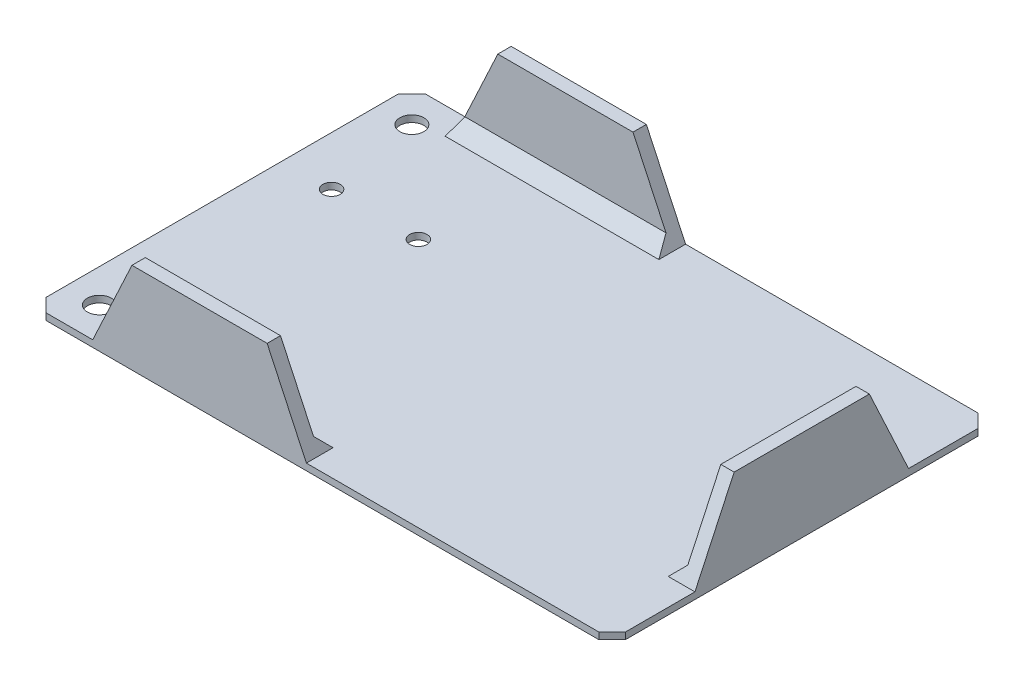
ISO-10303-21;
HEADER;
FILE_DESCRIPTION(('STEP AP214'),'2;1');
FILE_NAME('part.step','',(''),(''),'','','');
FILE_SCHEMA(('AUTOMOTIVE_DESIGN { 1 0 10303 214 1 1 1 1 }'));
ENDSEC;
DATA;
#1=APPLICATION_CONTEXT('core data for automotive mechanical design processes');
#2=APPLICATION_PROTOCOL_DEFINITION('international standard','automotive_design',2000,#1);
#3=PRODUCT_CONTEXT('',#1,'mechanical');
#4=PRODUCT('Part','Part','',(#3));
#5=PRODUCT_RELATED_PRODUCT_CATEGORY('part','',(#4));
#6=PRODUCT_DEFINITION_FORMATION('','',#4);
#7=PRODUCT_DEFINITION_CONTEXT('part definition',#1,'design');
#8=PRODUCT_DEFINITION('design','',#6,#7);
#9=PRODUCT_DEFINITION_SHAPE('','',#8);
#10=(LENGTH_UNIT() NAMED_UNIT(*) SI_UNIT(.MILLI.,.METRE.));
#11=(NAMED_UNIT(*) PLANE_ANGLE_UNIT() SI_UNIT($,.RADIAN.));
#12=(NAMED_UNIT(*) SI_UNIT($,.STERADIAN.) SOLID_ANGLE_UNIT());
#13=UNCERTAINTY_MEASURE_WITH_UNIT(LENGTH_MEASURE(1.E-05),#10,'distance_accuracy_value','');
#14=(GEOMETRIC_REPRESENTATION_CONTEXT(3) GLOBAL_UNCERTAINTY_ASSIGNED_CONTEXT((#13)) GLOBAL_UNIT_ASSIGNED_CONTEXT((#10,
#11,#12)) REPRESENTATION_CONTEXT('',''));
#15=CARTESIAN_POINT('',(0.,0.,0.));
#16=DIRECTION('',(0.,0.,1.));
#17=DIRECTION('',(1.,0.,0.));
#18=AXIS2_PLACEMENT_3D('',#15,#16,#17);
#19=CARTESIAN_POINT('',(0.,1.27,0.));
#20=DIRECTION('',(0.,-1.,0.));
#21=DIRECTION('',(0.,0.,-1.));
#22=AXIS2_PLACEMENT_3D('',#19,#20,#21);
#23=PLANE('',#22);
#24=CARTESIAN_POINT('',(25.873,1.27,-47.498));
#25=DIRECTION('',(0.,1.,0.));
#26=DIRECTION('',(0.,0.,1.));
#27=AXIS2_PLACEMENT_3D('',#24,#25,#26);
#28=CIRCLE('',#27,1.651);
#29=CARTESIAN_POINT('',(25.873,1.27,-45.847));
#30=VERTEX_POINT('',#29);
#31=EDGE_CURVE('E447',#30,#30,#28,.T.);
#32=ORIENTED_EDGE('',*,*,#31,.F.);
#33=EDGE_LOOP('',(#32));
#34=FACE_BOUND('',#33,.T.);
#35=CARTESIAN_POINT('',(9.363,1.27,-47.498));
#36=DIRECTION('',(0.,1.,0.));
#37=DIRECTION('',(0.,0.,1.));
#38=AXIS2_PLACEMENT_3D('',#35,#36,#37);
#39=CIRCLE('',#38,1.65099999999999);
#40=CARTESIAN_POINT('',(9.363,1.27,-45.847));
#41=VERTEX_POINT('',#40);
#42=EDGE_CURVE('E456',#41,#41,#39,.T.);
#43=ORIENTED_EDGE('',*,*,#42,.F.);
#44=EDGE_LOOP('',(#43));
#45=FACE_BOUND('',#44,.T.);
#46=CARTESIAN_POINT('',(6.35,1.27,-65.786));
#47=DIRECTION('',(0.,1.,0.));
#48=DIRECTION('',(0.,0.,1.));
#49=AXIS2_PLACEMENT_3D('',#46,#47,#48);
#50=CIRCLE('',#49,2.286);
#51=CARTESIAN_POINT('',(6.35,1.27,-63.5));
#52=VERTEX_POINT('',#51);
#53=EDGE_CURVE('E464',#52,#52,#50,.T.);
#54=ORIENTED_EDGE('',*,*,#53,.F.);
#55=EDGE_LOOP('',(#54));
#56=FACE_BOUND('',#55,.T.);
#57=CARTESIAN_POINT('',(6.35000000000001,1.27,-6.34999999999999));
#58=DIRECTION('',(0.,1.,0.));
#59=DIRECTION('',(0.,0.,-1.));
#60=AXIS2_PLACEMENT_3D('',#57,#58,#59);
#61=CIRCLE('',#60,2.286);
#62=CARTESIAN_POINT('',(6.35000000000001,1.27,-8.63599999999999));
#63=VERTEX_POINT('',#62);
#64=EDGE_CURVE('E472',#63,#63,#61,.T.);
#65=ORIENTED_EDGE('',*,*,#64,.F.);
#66=EDGE_LOOP('',(#65));
#67=FACE_BOUND('',#66,.T.);
#68=DIRECTION('',(1.,0.,0.));
#69=VECTOR('',#68,1.);
#70=CARTESIAN_POINT('',(0.,1.27,0.));
#71=LINE('',#70,#69);
#72=CARTESIAN_POINT('',(52.0700000000001,1.27,0.));
#73=VERTEX_POINT('',#72);
#74=CARTESIAN_POINT('',(107.696,1.27,0.));
#75=VERTEX_POINT('',#74);
#76=EDGE_CURVE('E236',#73,#75,#71,.T.);
#77=ORIENTED_EDGE('',*,*,#76,.T.);
#78=DIRECTION('',(-0.70710678118655,0.,0.707106781186546));
#79=VECTOR('',#78,1.);
#80=CARTESIAN_POINT('',(110.236,1.27,-2.54));
#81=LINE('',#80,#79);
#82=CARTESIAN_POINT('',(110.236,1.27,-2.54));
#83=VERTEX_POINT('',#82);
#84=EDGE_CURVE('E411',#75,#83,#81,.F.);
#85=ORIENTED_EDGE('',*,*,#84,.T.);
#86=DIRECTION('',(0.,0.,-1.));
#87=VECTOR('',#86,1.);
#88=CARTESIAN_POINT('',(110.236,1.27,0.));
#89=LINE('',#88,#87);
#90=CARTESIAN_POINT('',(110.236,1.27,-15.7479999999999));
#91=VERTEX_POINT('',#90);
#92=EDGE_CURVE('E230',#83,#91,#89,.T.);
#93=ORIENTED_EDGE('',*,*,#92,.T.);
#94=DIRECTION('',(-1.,0.,0.));
#95=VECTOR('',#94,1.);
#96=CARTESIAN_POINT('',(107.696,1.27,-15.7479999999999));
#97=LINE('',#96,#95);
#98=CARTESIAN_POINT('',(105.156,1.27,-15.7479999999999));
#99=VERTEX_POINT('',#98);
#100=EDGE_CURVE('E222',#91,#99,#97,.T.);
#101=ORIENTED_EDGE('',*,*,#100,.T.);
#102=DIRECTION('',(0.,0.,-1.));
#103=VECTOR('',#102,1.);
#104=CARTESIAN_POINT('',(105.156,1.27,-56.3880000000001));
#105=LINE('',#104,#103);
#106=CARTESIAN_POINT('',(105.156,1.27,-56.3880000000001));
#107=VERTEX_POINT('',#106);
#108=EDGE_CURVE('E218',#99,#107,#105,.T.);
#109=ORIENTED_EDGE('',*,*,#108,.T.);
#110=DIRECTION('',(1.,0.,0.));
#111=VECTOR('',#110,1.);
#112=CARTESIAN_POINT('',(110.236,1.27,-56.3880000000001));
#113=LINE('',#112,#111);
#114=CARTESIAN_POINT('',(110.236,1.27,-56.3880000000001));
#115=VERTEX_POINT('',#114);
#116=EDGE_CURVE('E202',#107,#115,#113,.T.);
#117=ORIENTED_EDGE('',*,*,#116,.T.);
#118=CARTESIAN_POINT('',(110.236,1.27,-69.596));
#119=VERTEX_POINT('',#118);
#120=EDGE_CURVE('E215',#115,#119,#89,.T.);
#121=ORIENTED_EDGE('',*,*,#120,.T.);
#122=DIRECTION('',(0.707106781186546,0.,0.707106781186549));
#123=VECTOR('',#122,1.);
#124=CARTESIAN_POINT('',(107.696,1.27,-72.136));
#125=LINE('',#124,#123);
#126=CARTESIAN_POINT('',(107.696,1.27,-72.136));
#127=VERTEX_POINT('',#126);
#128=EDGE_CURVE('E408',#119,#127,#125,.F.);
#129=ORIENTED_EDGE('',*,*,#128,.T.);
#130=DIRECTION('',(-1.,0.,0.));
#131=VECTOR('',#130,1.);
#132=CARTESIAN_POINT('',(0.,1.27,-72.136));
#133=LINE('',#132,#131);
#134=CARTESIAN_POINT('',(52.0700000000001,1.27,-72.136));
#135=VERTEX_POINT('',#134);
#136=EDGE_CURVE('E240',#127,#135,#133,.T.);
#137=ORIENTED_EDGE('',*,*,#136,.T.);
#138=DIRECTION('',(0.,0.,1.));
#139=VECTOR('',#138,1.);
#140=CARTESIAN_POINT('',(52.0700000000001,1.27,-69.596));
#141=LINE('',#140,#139);
#142=CARTESIAN_POINT('',(52.0700000000001,1.27,-67.056));
#143=VERTEX_POINT('',#142);
#144=EDGE_CURVE('E267',#135,#143,#141,.T.);
#145=ORIENTED_EDGE('',*,*,#144,.T.);
#146=DIRECTION('',(-1.,0.,0.));
#147=VECTOR('',#146,1.);
#148=CARTESIAN_POINT('',(11.4299999999999,1.27,-67.056));
#149=LINE('',#148,#147);
#150=CARTESIAN_POINT('',(11.4299999999999,1.27,-67.056));
#151=VERTEX_POINT('',#150);
#152=EDGE_CURVE('E341',#143,#151,#149,.T.);
#153=ORIENTED_EDGE('',*,*,#152,.T.);
#154=DIRECTION('',(0.,0.,-1.));
#155=VECTOR('',#154,1.);
#156=CARTESIAN_POINT('',(11.4299999999999,1.27,-72.136));
#157=LINE('',#156,#155);
#158=CARTESIAN_POINT('',(11.4299999999999,1.27,-72.136));
#159=VERTEX_POINT('',#158);
#160=EDGE_CURVE('E221',#151,#159,#157,.T.);
#161=ORIENTED_EDGE('',*,*,#160,.T.);
#162=CARTESIAN_POINT('',(2.54000000000001,1.27,-72.136));
#163=VERTEX_POINT('',#162);
#164=EDGE_CURVE('E235',#159,#163,#133,.T.);
#165=ORIENTED_EDGE('',*,*,#164,.T.);
#166=DIRECTION('',(0.70710678118655,0.,-0.707106781186546));
#167=VECTOR('',#166,1.);
#168=CARTESIAN_POINT('',(0.,1.27,-69.596));
#169=LINE('',#168,#167);
#170=CARTESIAN_POINT('',(0.,1.27,-69.596));
#171=VERTEX_POINT('',#170);
#172=EDGE_CURVE('E64',#163,#171,#169,.F.);
#173=ORIENTED_EDGE('',*,*,#172,.T.);
#174=DIRECTION('',(0.,0.,1.));
#175=VECTOR('',#174,1.);
#176=CARTESIAN_POINT('',(0.,1.27,0.));
#177=LINE('',#176,#175);
#178=CARTESIAN_POINT('',(0.,1.27,-2.54000000000001));
#179=VERTEX_POINT('',#178);
#180=EDGE_CURVE('E258',#171,#179,#177,.T.);
#181=ORIENTED_EDGE('',*,*,#180,.T.);
#182=DIRECTION('',(-0.707106781186546,0.,-0.70710678118655));
#183=VECTOR('',#182,1.);
#184=CARTESIAN_POINT('',(2.54,1.27,0.));
#185=LINE('',#184,#183);
#186=CARTESIAN_POINT('',(2.54,1.27,0.));
#187=VERTEX_POINT('',#186);
#188=EDGE_CURVE('E403',#179,#187,#185,.F.);
#189=ORIENTED_EDGE('',*,*,#188,.T.);
#190=CARTESIAN_POINT('',(11.4299999999999,1.27,0.));
#191=VERTEX_POINT('',#190);
#192=EDGE_CURVE('E231',#187,#191,#71,.T.);
#193=ORIENTED_EDGE('',*,*,#192,.T.);
#194=DIRECTION('',(0.,0.,-1.));
#195=VECTOR('',#194,1.);
#196=CARTESIAN_POINT('',(11.4299999999999,1.27,-2.54));
#197=LINE('',#196,#195);
#198=CARTESIAN_POINT('',(11.4299999999999,1.27,-5.08));
#199=VERTEX_POINT('',#198);
#200=EDGE_CURVE('E264',#191,#199,#197,.T.);
#201=ORIENTED_EDGE('',*,*,#200,.T.);
#202=DIRECTION('',(1.,0.,0.));
#203=VECTOR('',#202,1.);
#204=CARTESIAN_POINT('',(52.0700000000001,1.27,-5.08));
#205=LINE('',#204,#203);
#206=CARTESIAN_POINT('',(52.0700000000001,1.27,-5.08));
#207=VERTEX_POINT('',#206);
#208=EDGE_CURVE('E345',#199,#207,#205,.T.);
#209=ORIENTED_EDGE('',*,*,#208,.T.);
#210=DIRECTION('',(0.,0.,1.));
#211=VECTOR('',#210,1.);
#212=CARTESIAN_POINT('',(52.0700000000001,1.27,0.));
#213=LINE('',#212,#211);
#214=EDGE_CURVE('E270',#207,#73,#213,.T.);
#215=ORIENTED_EDGE('',*,*,#214,.T.);
#216=EDGE_LOOP('',(#77,#85,#93,#101,#109,#117,#121,#129,#137,#145,#153,#161,#165,#173,#181,#189,
#193,#201,#209,#215));
#217=FACE_BOUND('',#216,.T.);
#218=ADVANCED_FACE('F41',(#34,#45,#56,#67,#217),#23,.F.);
#219=CARTESIAN_POINT('',(0.,1.27,0.));
#220=DIRECTION('',(1.,0.,0.));
#221=DIRECTION('',(0.,0.,-1.));
#222=AXIS2_PLACEMENT_3D('',#219,#220,#221);
#223=PLANE('',#222);
#224=ORIENTED_EDGE('',*,*,#180,.F.);
#225=DIRECTION('',(0.,-1.,0.));
#226=VECTOR('',#225,1.);
#227=CARTESIAN_POINT('',(0.,1.27,-69.596));
#228=LINE('',#227,#226);
#229=CARTESIAN_POINT('',(0.,0.,-69.596));
#230=VERTEX_POINT('',#229);
#231=EDGE_CURVE('E11',#171,#230,#228,.T.);
#232=ORIENTED_EDGE('',*,*,#231,.T.);
#233=DIRECTION('',(0.,0.,1.));
#234=VECTOR('',#233,1.);
#235=CARTESIAN_POINT('',(0.,0.,0.));
#236=LINE('',#235,#234);
#237=CARTESIAN_POINT('',(0.,0.,-2.54000000000001));
#238=VERTEX_POINT('',#237);
#239=EDGE_CURVE('E243',#230,#238,#236,.T.);
#240=ORIENTED_EDGE('',*,*,#239,.T.);
#241=DIRECTION('',(0.,1.,0.));
#242=VECTOR('',#241,1.);
#243=CARTESIAN_POINT('',(0.,1.27,-2.54000000000001));
#244=LINE('',#243,#242);
#245=EDGE_CURVE('E51',#238,#179,#244,.T.);
#246=ORIENTED_EDGE('',*,*,#245,.T.);
#247=EDGE_LOOP('',(#224,#232,#240,#246));
#248=FACE_BOUND('',#247,.T.);
#249=ADVANCED_FACE('F429',(#248),#223,.F.);
#250=CARTESIAN_POINT('',(0.,1.27,0.));
#251=DIRECTION('',(0.,0.,-1.));
#252=DIRECTION('',(-1.,0.,0.));
#253=AXIS2_PLACEMENT_3D('',#250,#251,#252);
#254=PLANE('',#253);
#255=DIRECTION('',(1.,0.,0.));
#256=VECTOR('',#255,1.);
#257=CARTESIAN_POINT('',(0.,0.,0.));
#258=LINE('',#257,#256);
#259=CARTESIAN_POINT('',(2.54,0.,0.));
#260=VERTEX_POINT('',#259);
#261=CARTESIAN_POINT('',(107.696,0.,0.));
#262=VERTEX_POINT('',#261);
#263=EDGE_CURVE('E246',#260,#262,#258,.T.);
#264=ORIENTED_EDGE('',*,*,#263,.T.);
#265=DIRECTION('',(0.,1.,0.));
#266=VECTOR('',#265,1.);
#267=CARTESIAN_POINT('',(107.696,1.27,0.));
#268=LINE('',#267,#266);
#269=EDGE_CURVE('E400',#262,#75,#268,.T.);
#270=ORIENTED_EDGE('',*,*,#269,.T.);
#271=ORIENTED_EDGE('',*,*,#76,.F.);
#272=DIRECTION('',(0.422618261740696,-0.906307787036652,0.));
#273=VECTOR('',#272,1.);
#274=CARTESIAN_POINT('',(42.7699754181893,21.2139670766025,0.));
#275=LINE('',#274,#273);
#276=CARTESIAN_POINT('',(44.6090774695202,17.27,0.));
#277=VERTEX_POINT('',#276);
#278=EDGE_CURVE('E282',#73,#277,#275,.F.);
#279=ORIENTED_EDGE('',*,*,#278,.T.);
#280=DIRECTION('',(1.,0.,0.));
#281=VECTOR('',#280,1.);
#282=CARTESIAN_POINT('',(44.45,17.27,0.));
#283=LINE('',#282,#281);
#284=CARTESIAN_POINT('',(18.8909225304798,17.27,0.));
#285=VERTEX_POINT('',#284);
#286=EDGE_CURVE('E485',#285,#277,#283,.T.);
#287=ORIENTED_EDGE('',*,*,#286,.F.);
#288=DIRECTION('',(0.422618261740696,0.906307787036651,0.));
#289=VECTOR('',#288,1.);
#290=CARTESIAN_POINT('',(9.38853118935851,-3.10794399242489,0.));
#291=LINE('',#290,#289);
#292=EDGE_CURVE('E301',#285,#191,#291,.F.);
#293=ORIENTED_EDGE('',*,*,#292,.T.);
#294=ORIENTED_EDGE('',*,*,#192,.F.);
#295=DIRECTION('',(0.,-1.,0.));
#296=VECTOR('',#295,1.);
#297=CARTESIAN_POINT('',(2.54,1.27,0.));
#298=LINE('',#297,#296);
#299=EDGE_CURVE('E396',#187,#260,#298,.T.);
#300=ORIENTED_EDGE('',*,*,#299,.T.);
#301=EDGE_LOOP('',(#264,#270,#271,#279,#287,#293,#294,#300));
#302=FACE_BOUND('',#301,.T.);
#303=ADVANCED_FACE('F440',(#302),#254,.F.);
#304=CARTESIAN_POINT('',(110.236,1.27,0.));
#305=DIRECTION('',(-1.,0.,0.));
#306=DIRECTION('',(0.,0.,1.));
#307=AXIS2_PLACEMENT_3D('',#304,#305,#306);
#308=PLANE('',#307);
#309=ORIENTED_EDGE('',*,*,#92,.F.);
#310=DIRECTION('',(0.,-1.,0.));
#311=VECTOR('',#310,1.);
#312=CARTESIAN_POINT('',(110.236,1.27,-2.54));
#313=LINE('',#312,#311);
#314=CARTESIAN_POINT('',(110.236,0.,-2.54));
#315=VERTEX_POINT('',#314);
#316=EDGE_CURVE('E380',#83,#315,#313,.T.);
#317=ORIENTED_EDGE('',*,*,#316,.T.);
#318=DIRECTION('',(0.,0.,-1.));
#319=VECTOR('',#318,1.);
#320=CARTESIAN_POINT('',(110.236,0.,0.));
#321=LINE('',#320,#319);
#322=CARTESIAN_POINT('',(110.236,0.,-69.596));
#323=VERTEX_POINT('',#322);
#324=EDGE_CURVE('E251',#315,#323,#321,.T.);
#325=ORIENTED_EDGE('',*,*,#324,.T.);
#326=DIRECTION('',(0.,1.,0.));
#327=VECTOR('',#326,1.);
#328=CARTESIAN_POINT('',(110.236,1.27,-69.596));
#329=LINE('',#328,#327);
#330=EDGE_CURVE('E228',#323,#119,#329,.T.);
#331=ORIENTED_EDGE('',*,*,#330,.T.);
#332=ORIENTED_EDGE('',*,*,#120,.F.);
#333=DIRECTION('',(0.,-0.906307787036652,-0.422618261740696));
#334=VECTOR('',#333,1.);
#335=CARTESIAN_POINT('',(110.236,22.8678570292964,-46.3167538675025));
#336=LINE('',#335,#334);
#337=CARTESIAN_POINT('',(110.236,17.27,-48.9270774695202));
#338=VERTEX_POINT('',#337);
#339=EDGE_CURVE('E199',#115,#338,#336,.F.);
#340=ORIENTED_EDGE('',*,*,#339,.T.);
#341=DIRECTION('',(0.,0.,-1.));
#342=VECTOR('',#341,1.);
#343=CARTESIAN_POINT('',(110.236,17.27,-23.368));
#344=LINE('',#343,#342);
#345=CARTESIAN_POINT('',(110.236,17.27,-23.2089225304798));
#346=VERTEX_POINT('',#345);
#347=EDGE_CURVE('E496',#346,#338,#344,.T.);
#348=ORIENTED_EDGE('',*,*,#347,.F.);
#349=DIRECTION('',(0.,0.906307787036651,-0.422618261740696));
#350=VECTOR('',#349,1.);
#351=CARTESIAN_POINT('',(110.236,-4.76183394511875,-12.9353096386718));
#352=LINE('',#351,#350);
#353=EDGE_CURVE('E328',#346,#91,#352,.F.);
#354=ORIENTED_EDGE('',*,*,#353,.T.);
#355=EDGE_LOOP('',(#309,#317,#325,#331,#332,#340,#348,#354));
#356=FACE_BOUND('',#355,.T.);
#357=ADVANCED_FACE('F225',(#356),#308,.F.);
#358=CARTESIAN_POINT('',(0.,1.27,-72.136));
#359=DIRECTION('',(0.,0.,1.));
#360=DIRECTION('',(1.,0.,0.));
#361=AXIS2_PLACEMENT_3D('',#358,#359,#360);
#362=PLANE('',#361);
#363=ORIENTED_EDGE('',*,*,#136,.F.);
#364=DIRECTION('',(0.,-1.,0.));
#365=VECTOR('',#364,1.);
#366=CARTESIAN_POINT('',(107.696,1.27,-72.136));
#367=LINE('',#366,#365);
#368=CARTESIAN_POINT('',(107.696,0.,-72.136));
#369=VERTEX_POINT('',#368);
#370=EDGE_CURVE('E417',#127,#369,#367,.T.);
#371=ORIENTED_EDGE('',*,*,#370,.T.);
#372=DIRECTION('',(-1.,0.,0.));
#373=VECTOR('',#372,1.);
#374=CARTESIAN_POINT('',(0.,0.,-72.136));
#375=LINE('',#374,#373);
#376=CARTESIAN_POINT('',(2.54000000000001,0.,-72.136));
#377=VERTEX_POINT('',#376);
#378=EDGE_CURVE('E254',#369,#377,#375,.T.);
#379=ORIENTED_EDGE('',*,*,#378,.T.);
#380=DIRECTION('',(0.,1.,0.));
#381=VECTOR('',#380,1.);
#382=CARTESIAN_POINT('',(2.54000000000001,1.27,-72.136));
#383=LINE('',#382,#381);
#384=EDGE_CURVE('E414',#377,#163,#383,.T.);
#385=ORIENTED_EDGE('',*,*,#384,.T.);
#386=ORIENTED_EDGE('',*,*,#164,.F.);
#387=DIRECTION('',(-0.422618261740696,-0.906307787036651,0.));
#388=VECTOR('',#387,1.);
#389=CARTESIAN_POINT('',(9.3885311893585,-3.10794399242488,-72.136));
#390=LINE('',#389,#388);
#391=CARTESIAN_POINT('',(18.8909225304798,17.27,-72.136));
#392=VERTEX_POINT('',#391);
#393=EDGE_CURVE('E316',#159,#392,#390,.F.);
#394=ORIENTED_EDGE('',*,*,#393,.T.);
#395=DIRECTION('',(-1.,0.,0.));
#396=VECTOR('',#395,1.);
#397=CARTESIAN_POINT('',(19.05,17.27,-72.136));
#398=LINE('',#397,#396);
#399=CARTESIAN_POINT('',(44.6090774695202,17.27,-72.136));
#400=VERTEX_POINT('',#399);
#401=EDGE_CURVE('E452',#400,#392,#398,.T.);
#402=ORIENTED_EDGE('',*,*,#401,.F.);
#403=DIRECTION('',(-0.422618261740696,0.906307787036651,0.));
#404=VECTOR('',#403,1.);
#405=CARTESIAN_POINT('',(42.7699754181893,21.2139670766025,-72.136));
#406=LINE('',#405,#404);
#407=EDGE_CURVE('E290',#400,#135,#406,.F.);
#408=ORIENTED_EDGE('',*,*,#407,.T.);
#409=EDGE_LOOP('',(#363,#371,#379,#385,#386,#394,#402,#408));
#410=FACE_BOUND('',#409,.T.);
#411=ADVANCED_FACE('F515',(#410),#362,.F.);
#412=CARTESIAN_POINT('',(0.,0.,0.));
#413=DIRECTION('',(0.,-1.,0.));
#414=DIRECTION('',(0.,0.,-1.));
#415=AXIS2_PLACEMENT_3D('',#412,#413,#414);
#416=PLANE('',#415);
#417=CARTESIAN_POINT('',(6.35000000000001,0.,-6.34999999999999));
#418=DIRECTION('',(0.,1.,0.));
#419=DIRECTION('',(0.,0.,-1.));
#420=AXIS2_PLACEMENT_3D('',#417,#418,#419);
#421=CIRCLE('',#420,2.286);
#422=CARTESIAN_POINT('',(6.35000000000001,0.,-8.63599999999999));
#423=VERTEX_POINT('',#422);
#424=EDGE_CURVE('E247',#423,#423,#421,.T.);
#425=ORIENTED_EDGE('',*,*,#424,.T.);
#426=EDGE_LOOP('',(#425));
#427=FACE_BOUND('',#426,.T.);
#428=CARTESIAN_POINT('',(6.35,0.,-65.786));
#429=DIRECTION('',(0.,1.,0.));
#430=DIRECTION('',(0.,0.,1.));
#431=AXIS2_PLACEMENT_3D('',#428,#429,#430);
#432=CIRCLE('',#431,2.286);
#433=CARTESIAN_POINT('',(6.35,0.,-63.5));
#434=VERTEX_POINT('',#433);
#435=EDGE_CURVE('E468',#434,#434,#432,.T.);
#436=ORIENTED_EDGE('',*,*,#435,.T.);
#437=EDGE_LOOP('',(#436));
#438=FACE_BOUND('',#437,.T.);
#439=CARTESIAN_POINT('',(9.363,0.,-47.498));
#440=DIRECTION('',(0.,1.,0.));
#441=DIRECTION('',(0.,0.,1.));
#442=AXIS2_PLACEMENT_3D('',#439,#440,#441);
#443=CIRCLE('',#442,1.65099999999999);
#444=CARTESIAN_POINT('',(9.363,0.,-45.847));
#445=VERTEX_POINT('',#444);
#446=EDGE_CURVE('E460',#445,#445,#443,.T.);
#447=ORIENTED_EDGE('',*,*,#446,.T.);
#448=EDGE_LOOP('',(#447));
#449=FACE_BOUND('',#448,.T.);
#450=CARTESIAN_POINT('',(25.873,0.,-47.498));
#451=DIRECTION('',(0.,1.,0.));
#452=DIRECTION('',(0.,0.,1.));
#453=AXIS2_PLACEMENT_3D('',#450,#451,#452);
#454=CIRCLE('',#453,1.651);
#455=CARTESIAN_POINT('',(25.873,0.,-45.847));
#456=VERTEX_POINT('',#455);
#457=EDGE_CURVE('E451',#456,#456,#454,.T.);
#458=ORIENTED_EDGE('',*,*,#457,.T.);
#459=EDGE_LOOP('',(#458));
#460=FACE_BOUND('',#459,.T.);
#461=ORIENTED_EDGE('',*,*,#324,.F.);
#462=DIRECTION('',(0.70710678118655,0.,-0.707106781186546));
#463=VECTOR('',#462,1.);
#464=CARTESIAN_POINT('',(53.8479999999997,0.,53.848));
#465=LINE('',#464,#463);
#466=EDGE_CURVE('E393',#315,#262,#465,.F.);
#467=ORIENTED_EDGE('',*,*,#466,.T.);
#468=ORIENTED_EDGE('',*,*,#263,.F.);
#469=DIRECTION('',(0.707106781186546,0.,0.70710678118655));
#470=VECTOR('',#469,1.);
#471=CARTESIAN_POINT('',(1.27000000000001,0.,-1.27));
#472=LINE('',#471,#470);
#473=EDGE_CURVE('E384',#260,#238,#472,.F.);
#474=ORIENTED_EDGE('',*,*,#473,.T.);
#475=ORIENTED_EDGE('',*,*,#239,.F.);
#476=DIRECTION('',(-0.70710678118655,0.,0.707106781186546));
#477=VECTOR('',#476,1.);
#478=CARTESIAN_POINT('',(-34.798,0.,-34.7980000000002));
#479=LINE('',#478,#477);
#480=EDGE_CURVE('E387',#230,#377,#479,.F.);
#481=ORIENTED_EDGE('',*,*,#480,.T.);
#482=ORIENTED_EDGE('',*,*,#378,.F.);
#483=DIRECTION('',(-0.707106781186546,0.,-0.707106781186549));
#484=VECTOR('',#483,1.);
#485=CARTESIAN_POINT('',(89.9160000000003,0.,-89.9159999999998));
#486=LINE('',#485,#484);
#487=EDGE_CURVE('E390',#369,#323,#486,.F.);
#488=ORIENTED_EDGE('',*,*,#487,.T.);
#489=EDGE_LOOP('',(#461,#467,#468,#474,#475,#481,#482,#488));
#490=FACE_BOUND('',#489,.T.);
#491=ADVANCED_FACE('F432',(#427,#438,#449,#460,#490),#416,.T.);
#492=CARTESIAN_POINT('',(25.873,0.,-47.498));
#493=DIRECTION('',(0.,1.,0.));
#494=DIRECTION('',(0.,0.,1.));
#495=AXIS2_PLACEMENT_3D('',#492,#493,#494);
#496=CYLINDRICAL_SURFACE('',#495,1.651);
#497=ORIENTED_EDGE('',*,*,#457,.F.);
#498=EDGE_LOOP('',(#497));
#499=FACE_BOUND('',#498,.T.);
#500=ORIENTED_EDGE('',*,*,#31,.T.);
#501=EDGE_LOOP('',(#500));
#502=FACE_BOUND('',#501,.T.);
#503=ADVANCED_FACE('F558',(#499,#502),#496,.F.);
#504=CARTESIAN_POINT('',(9.363,0.,-47.498));
#505=DIRECTION('',(0.,1.,0.));
#506=DIRECTION('',(0.,0.,1.));
#507=AXIS2_PLACEMENT_3D('',#504,#505,#506);
#508=CYLINDRICAL_SURFACE('',#507,1.65099999999999);
#509=ORIENTED_EDGE('',*,*,#446,.F.);
#510=EDGE_LOOP('',(#509));
#511=FACE_BOUND('',#510,.T.);
#512=ORIENTED_EDGE('',*,*,#42,.T.);
#513=EDGE_LOOP('',(#512));
#514=FACE_BOUND('',#513,.T.);
#515=ADVANCED_FACE('F811',(#511,#514),#508,.F.);
#516=CARTESIAN_POINT('',(6.35,0.,-65.786));
#517=DIRECTION('',(0.,1.,0.));
#518=DIRECTION('',(0.,0.,1.));
#519=AXIS2_PLACEMENT_3D('',#516,#517,#518);
#520=CYLINDRICAL_SURFACE('',#519,2.286);
#521=ORIENTED_EDGE('',*,*,#435,.F.);
#522=EDGE_LOOP('',(#521));
#523=FACE_BOUND('',#522,.T.);
#524=ORIENTED_EDGE('',*,*,#53,.T.);
#525=EDGE_LOOP('',(#524));
#526=FACE_BOUND('',#525,.T.);
#527=ADVANCED_FACE('F801',(#523,#526),#520,.F.);
#528=CARTESIAN_POINT('',(6.35000000000001,0.,-6.34999999999999));
#529=DIRECTION('',(0.,1.,0.));
#530=DIRECTION('',(0.,0.,1.));
#531=AXIS2_PLACEMENT_3D('',#528,#529,#530);
#532=CYLINDRICAL_SURFACE('',#531,2.286);
#533=ORIENTED_EDGE('',*,*,#424,.F.);
#534=EDGE_LOOP('',(#533));
#535=FACE_BOUND('',#534,.T.);
#536=ORIENTED_EDGE('',*,*,#64,.T.);
#537=EDGE_LOOP('',(#536));
#538=FACE_BOUND('',#537,.T.);
#539=ADVANCED_FACE('F545',(#535,#538),#532,.F.);
#540=CARTESIAN_POINT('',(19.05,17.27,-69.596));
#541=DIRECTION('',(0.,0.,-1.));
#542=DIRECTION('',(-1.,0.,0.));
#543=AXIS2_PLACEMENT_3D('',#540,#541,#542);
#544=PLANE('',#543);
#545=DIRECTION('',(0.422618261740696,0.906307787036651,0.));
#546=VECTOR('',#545,1.);
#547=CARTESIAN_POINT('',(18.919334752046,17.3309302057757,-69.596));
#548=LINE('',#547,#546);
#549=CARTESIAN_POINT('',(18.8909225304798,17.27,-69.596));
#550=VERTEX_POINT('',#549);
#551=CARTESIAN_POINT('',(12.6144214517136,3.81000000000003,-69.596));
#552=VERTEX_POINT('',#551);
#553=EDGE_CURVE('E312',#550,#552,#548,.F.);
#554=ORIENTED_EDGE('',*,*,#553,.T.);
#555=DIRECTION('',(1.,0.,0.));
#556=VECTOR('',#555,1.);
#557=CARTESIAN_POINT('',(52.0700000000001,3.81000000000003,-69.596));
#558=LINE('',#557,#556);
#559=CARTESIAN_POINT('',(50.8855785482864,3.81000000000003,-69.596));
#560=VERTEX_POINT('',#559);
#561=EDGE_CURVE('E349',#552,#560,#558,.T.);
#562=ORIENTED_EDGE('',*,*,#561,.T.);
#563=DIRECTION('',(0.422618261740696,-0.906307787036651,0.));
#564=VECTOR('',#563,1.);
#565=CARTESIAN_POINT('',(40.0440678909732,27.0596946333867,-69.596));
#566=LINE('',#565,#564);
#567=CARTESIAN_POINT('',(44.6090774695202,17.27,-69.596));
#568=VERTEX_POINT('',#567);
#569=EDGE_CURVE('E294',#560,#568,#566,.F.);
#570=ORIENTED_EDGE('',*,*,#569,.T.);
#571=DIRECTION('',(1.,0.,0.));
#572=VECTOR('',#571,1.);
#573=CARTESIAN_POINT('',(19.05,17.27,-69.596));
#574=LINE('',#573,#572);
#575=EDGE_CURVE('E481',#550,#568,#574,.T.);
#576=ORIENTED_EDGE('',*,*,#575,.F.);
#577=EDGE_LOOP('',(#554,#562,#570,#576));
#578=FACE_BOUND('',#577,.T.);
#579=ADVANCED_FACE('F532',(#578),#544,.F.);
#580=CARTESIAN_POINT('',(0.,17.27,0.));
#581=DIRECTION('',(0.,1.,0.));
#582=DIRECTION('',(0.,0.,1.));
#583=AXIS2_PLACEMENT_3D('',#580,#581,#582);
#584=PLANE('',#583);
#585=ORIENTED_EDGE('',*,*,#401,.T.);
#586=DIRECTION('',(0.,0.,-1.));
#587=VECTOR('',#586,1.);
#588=CARTESIAN_POINT('',(18.8909225304798,17.27,-72.136));
#589=LINE('',#588,#587);
#590=EDGE_CURVE('E308',#392,#550,#589,.F.);
#591=ORIENTED_EDGE('',*,*,#590,.T.);
#592=ORIENTED_EDGE('',*,*,#575,.T.);
#593=DIRECTION('',(0.,0.,1.));
#594=VECTOR('',#593,1.);
#595=CARTESIAN_POINT('',(44.6090774695202,17.27,-72.136));
#596=LINE('',#595,#594);
#597=EDGE_CURVE('E286',#568,#400,#596,.F.);
#598=ORIENTED_EDGE('',*,*,#597,.T.);
#599=EDGE_LOOP('',(#585,#591,#592,#598));
#600=FACE_BOUND('',#599,.T.);
#601=ADVANCED_FACE('F534',(#600),#584,.T.);
#602=CARTESIAN_POINT('',(44.45,17.27,-2.54));
#603=DIRECTION('',(0.,0.,1.));
#604=DIRECTION('',(1.,0.,0.));
#605=AXIS2_PLACEMENT_3D('',#602,#603,#604);
#606=PLANE('',#605);
#607=DIRECTION('',(-0.422618261740696,0.906307787036652,0.));
#608=VECTOR('',#607,1.);
#609=CARTESIAN_POINT('',(44.580665247954,17.3309302057757,-2.54));
#610=LINE('',#609,#608);
#611=CARTESIAN_POINT('',(44.6090774695202,17.27,-2.54));
#612=VERTEX_POINT('',#611);
#613=CARTESIAN_POINT('',(50.8855785482864,3.81000000000002,-2.54));
#614=VERTEX_POINT('',#613);
#615=EDGE_CURVE('E278',#612,#614,#610,.F.);
#616=ORIENTED_EDGE('',*,*,#615,.T.);
#617=DIRECTION('',(-1.,0.,0.));
#618=VECTOR('',#617,1.);
#619=CARTESIAN_POINT('',(11.4299999999999,3.81000000000003,-2.54));
#620=LINE('',#619,#618);
#621=CARTESIAN_POINT('',(12.6144214517136,3.81000000000003,-2.54));
#622=VERTEX_POINT('',#621);
#623=EDGE_CURVE('E335',#614,#622,#620,.T.);
#624=ORIENTED_EDGE('',*,*,#623,.T.);
#625=DIRECTION('',(-0.422618261740696,-0.906307787036651,0.));
#626=VECTOR('',#625,1.);
#627=CARTESIAN_POINT('',(23.4559321090268,27.0596946333867,-2.54));
#628=LINE('',#627,#626);
#629=CARTESIAN_POINT('',(18.8909225304798,17.27,-2.54));
#630=VERTEX_POINT('',#629);
#631=EDGE_CURVE('E305',#622,#630,#628,.F.);
#632=ORIENTED_EDGE('',*,*,#631,.T.);
#633=DIRECTION('',(-1.,0.,0.));
#634=VECTOR('',#633,1.);
#635=CARTESIAN_POINT('',(44.45,17.27,-2.54));
#636=LINE('',#635,#634);
#637=EDGE_CURVE('E488',#612,#630,#636,.T.);
#638=ORIENTED_EDGE('',*,*,#637,.F.);
#639=EDGE_LOOP('',(#616,#624,#632,#638));
#640=FACE_BOUND('',#639,.T.);
#641=ADVANCED_FACE('F536',(#640),#606,.F.);
#642=CARTESIAN_POINT('',(0.,17.27,0.));
#643=DIRECTION('',(0.,1.,0.));
#644=DIRECTION('',(0.,0.,1.));
#645=AXIS2_PLACEMENT_3D('',#642,#643,#644);
#646=PLANE('',#645);
#647=ORIENTED_EDGE('',*,*,#286,.T.);
#648=DIRECTION('',(0.,0.,1.));
#649=VECTOR('',#648,1.);
#650=CARTESIAN_POINT('',(44.6090774695202,17.27,0.));
#651=LINE('',#650,#649);
#652=EDGE_CURVE('E274',#277,#612,#651,.F.);
#653=ORIENTED_EDGE('',*,*,#652,.T.);
#654=ORIENTED_EDGE('',*,*,#637,.T.);
#655=DIRECTION('',(0.,0.,-1.));
#656=VECTOR('',#655,1.);
#657=CARTESIAN_POINT('',(18.8909225304798,17.27,0.));
#658=LINE('',#657,#656);
#659=EDGE_CURVE('E297',#630,#285,#658,.F.);
#660=ORIENTED_EDGE('',*,*,#659,.T.);
#661=EDGE_LOOP('',(#647,#653,#654,#660));
#662=FACE_BOUND('',#661,.T.);
#663=ADVANCED_FACE('F542',(#662),#646,.T.);
#664=CARTESIAN_POINT('',(107.696,17.27,-23.368));
#665=DIRECTION('',(1.,0.,0.));
#666=DIRECTION('',(0.,0.,-1.));
#667=AXIS2_PLACEMENT_3D('',#664,#665,#666);
#668=PLANE('',#667);
#669=DIRECTION('',(0.,0.906307787036652,0.422618261740696));
#670=VECTOR('',#669,1.);
#671=CARTESIAN_POINT('',(107.696,27.0596946333867,-44.3620678909732));
#672=LINE('',#671,#670);
#673=CARTESIAN_POINT('',(107.696,17.27,-48.9270774695202));
#674=VERTEX_POINT('',#673);
#675=CARTESIAN_POINT('',(107.696,3.81000000000001,-55.2035785482864));
#676=VERTEX_POINT('',#675);
#677=EDGE_CURVE('E211',#674,#676,#672,.F.);
#678=ORIENTED_EDGE('',*,*,#677,.T.);
#679=DIRECTION('',(0.,0.,1.));
#680=VECTOR('',#679,1.);
#681=CARTESIAN_POINT('',(107.696,3.81000000000003,-15.7479999999999));
#682=LINE('',#681,#680);
#683=CARTESIAN_POINT('',(107.696,3.81000000000003,-16.9324214517136));
#684=VERTEX_POINT('',#683);
#685=EDGE_CURVE('E353',#676,#684,#682,.T.);
#686=ORIENTED_EDGE('',*,*,#685,.T.);
#687=DIRECTION('',(0.,-0.906307787036651,0.422618261740696));
#688=VECTOR('',#687,1.);
#689=CARTESIAN_POINT('',(107.696,17.3309302057757,-23.237334752046));
#690=LINE('',#689,#688);
#691=CARTESIAN_POINT('',(107.696,17.27,-23.2089225304798));
#692=VERTEX_POINT('',#691);
#693=EDGE_CURVE('E332',#684,#692,#690,.F.);
#694=ORIENTED_EDGE('',*,*,#693,.T.);
#695=DIRECTION('',(0.,0.,1.));
#696=VECTOR('',#695,1.);
#697=CARTESIAN_POINT('',(107.696,17.27,-23.368));
#698=LINE('',#697,#696);
#699=EDGE_CURVE('E492',#674,#692,#698,.T.);
#700=ORIENTED_EDGE('',*,*,#699,.F.);
#701=EDGE_LOOP('',(#678,#686,#694,#700));
#702=FACE_BOUND('',#701,.T.);
#703=ADVANCED_FACE('F758',(#702),#668,.F.);
#704=CARTESIAN_POINT('',(0.,17.27,0.));
#705=DIRECTION('',(0.,1.,0.));
#706=DIRECTION('',(0.,0.,1.));
#707=AXIS2_PLACEMENT_3D('',#704,#705,#706);
#708=PLANE('',#707);
#709=ORIENTED_EDGE('',*,*,#347,.T.);
#710=DIRECTION('',(1.,0.,0.));
#711=VECTOR('',#710,1.);
#712=CARTESIAN_POINT('',(110.236,17.27,-48.9270774695202));
#713=LINE('',#712,#711);
#714=EDGE_CURVE('E206',#338,#674,#713,.F.);
#715=ORIENTED_EDGE('',*,*,#714,.T.);
#716=ORIENTED_EDGE('',*,*,#699,.T.);
#717=DIRECTION('',(-1.,0.,0.));
#718=VECTOR('',#717,1.);
#719=CARTESIAN_POINT('',(110.236,17.27,-23.2089225304798));
#720=LINE('',#719,#718);
#721=EDGE_CURVE('E210',#692,#346,#720,.F.);
#722=ORIENTED_EDGE('',*,*,#721,.T.);
#723=EDGE_LOOP('',(#709,#715,#716,#722));
#724=FACE_BOUND('',#723,.T.);
#725=ADVANCED_FACE('F499',(#724),#708,.T.);
#726=CARTESIAN_POINT('',(44.45,17.6111427342832,0.));
#727=DIRECTION('',(0.906307787036651,0.422618261740696,0.));
#728=DIRECTION('',(0.,0.,1.));
#729=AXIS2_PLACEMENT_3D('',#726,#727,#728);
#730=PLANE('',#729);
#731=ORIENTED_EDGE('',*,*,#278,.F.);
#732=ORIENTED_EDGE('',*,*,#214,.F.);
#733=DIRECTION('',(-0.313145613014972,0.671542934237822,0.671542934237815));
#734=VECTOR('',#733,1.);
#735=CARTESIAN_POINT('',(46.818113856495,12.532706180475,6.18270618047489));
#736=LINE('',#735,#734);
#737=EDGE_CURVE('E361',#207,#614,#736,.T.);
#738=ORIENTED_EDGE('',*,*,#737,.T.);
#739=ORIENTED_EDGE('',*,*,#615,.F.);
#740=ORIENTED_EDGE('',*,*,#652,.F.);
#741=EDGE_LOOP('',(#731,#732,#738,#739,#740));
#742=FACE_BOUND('',#741,.T.);
#743=ADVANCED_FACE('F570',(#742),#730,.T.);
#744=CARTESIAN_POINT('',(44.45,17.6111427342832,-72.136));
#745=DIRECTION('',(0.906307787036651,0.422618261740696,0.));
#746=DIRECTION('',(0.,0.,1.));
#747=AXIS2_PLACEMENT_3D('',#744,#745,#746);
#748=PLANE('',#747);
#749=ORIENTED_EDGE('',*,*,#569,.F.);
#750=DIRECTION('',(0.31314561301497,-0.671542934237822,0.671542934237815));
#751=VECTOR('',#750,1.);
#752=CARTESIAN_POINT('',(46.8181138564951,12.532706180475,-78.3187061804749));
#753=LINE('',#752,#751);
#754=EDGE_CURVE('E364',#560,#143,#753,.T.);
#755=ORIENTED_EDGE('',*,*,#754,.T.);
#756=ORIENTED_EDGE('',*,*,#144,.F.);
#757=ORIENTED_EDGE('',*,*,#407,.F.);
#758=ORIENTED_EDGE('',*,*,#597,.F.);
#759=EDGE_LOOP('',(#749,#755,#756,#757,#758));
#760=FACE_BOUND('',#759,.T.);
#761=ADVANCED_FACE('F522',(#760),#748,.T.);
#762=CARTESIAN_POINT('',(19.05,17.6111427342832,0.));
#763=DIRECTION('',(-0.906307787036651,0.422618261740696,0.));
#764=DIRECTION('',(0.,0.,-1.));
#765=AXIS2_PLACEMENT_3D('',#762,#763,#764);
#766=PLANE('',#765);
#767=ORIENTED_EDGE('',*,*,#631,.F.);
#768=DIRECTION('',(-0.313145613014972,-0.671542934237822,-0.671542934237815));
#769=VECTOR('',#768,1.);
#770=CARTESIAN_POINT('',(16.681886143505,12.532706180475,6.18270618047488));
#771=LINE('',#770,#769);
#772=EDGE_CURVE('E357',#622,#199,#771,.T.);
#773=ORIENTED_EDGE('',*,*,#772,.T.);
#774=ORIENTED_EDGE('',*,*,#200,.F.);
#775=ORIENTED_EDGE('',*,*,#292,.F.);
#776=ORIENTED_EDGE('',*,*,#659,.F.);
#777=EDGE_LOOP('',(#767,#773,#774,#775,#776));
#778=FACE_BOUND('',#777,.T.);
#779=ADVANCED_FACE('F582',(#778),#766,.T.);
#780=CARTESIAN_POINT('',(19.05,17.6111427342832,-72.136));
#781=DIRECTION('',(-0.906307787036651,0.422618261740696,0.));
#782=DIRECTION('',(0.,0.,-1.));
#783=AXIS2_PLACEMENT_3D('',#780,#781,#782);
#784=PLANE('',#783);
#785=ORIENTED_EDGE('',*,*,#393,.F.);
#786=ORIENTED_EDGE('',*,*,#160,.F.);
#787=DIRECTION('',(0.313145613014969,0.671542934237823,-0.671542934237815));
#788=VECTOR('',#787,1.);
#789=CARTESIAN_POINT('',(16.6818861435049,12.532706180475,-78.3187061804749));
#790=LINE('',#789,#788);
#791=EDGE_CURVE('E368',#151,#552,#790,.T.);
#792=ORIENTED_EDGE('',*,*,#791,.T.);
#793=ORIENTED_EDGE('',*,*,#553,.F.);
#794=ORIENTED_EDGE('',*,*,#590,.F.);
#795=EDGE_LOOP('',(#785,#786,#792,#793,#794));
#796=FACE_BOUND('',#795,.T.);
#797=ADVANCED_FACE('F529',(#796),#784,.T.);
#798=CARTESIAN_POINT('',(110.236,17.6111427342832,-48.768));
#799=DIRECTION('',(0.,0.422618261740696,-0.906307787036651));
#800=DIRECTION('',(1.,0.,0.));
#801=AXIS2_PLACEMENT_3D('',#798,#799,#800);
#802=PLANE('',#801);
#803=ORIENTED_EDGE('',*,*,#339,.F.);
#804=ORIENTED_EDGE('',*,*,#116,.F.);
#805=DIRECTION('',(0.671542934237815,0.671542934237822,0.313145613014972));
#806=VECTOR('',#805,1.);
#807=CARTESIAN_POINT('',(116.418706180475,12.532706180475,-51.136113856495));
#808=LINE('',#807,#806);
#809=EDGE_CURVE('E375',#107,#676,#808,.T.);
#810=ORIENTED_EDGE('',*,*,#809,.T.);
#811=ORIENTED_EDGE('',*,*,#677,.F.);
#812=ORIENTED_EDGE('',*,*,#714,.F.);
#813=EDGE_LOOP('',(#803,#804,#810,#811,#812));
#814=FACE_BOUND('',#813,.T.);
#815=ADVANCED_FACE('F201',(#814),#802,.T.);
#816=CARTESIAN_POINT('',(110.236,17.6111427342832,-23.368));
#817=DIRECTION('',(0.,0.422618261740696,0.906307787036651));
#818=DIRECTION('',(-1.,0.,0.));
#819=AXIS2_PLACEMENT_3D('',#816,#817,#818);
#820=PLANE('',#819);
#821=ORIENTED_EDGE('',*,*,#693,.F.);
#822=DIRECTION('',(-0.671542934237815,-0.671542934237822,0.313145613014972));
#823=VECTOR('',#822,1.);
#824=CARTESIAN_POINT('',(116.418706180475,12.532706180475,-20.999886143505));
#825=LINE('',#824,#823);
#826=EDGE_CURVE('E371',#684,#99,#825,.T.);
#827=ORIENTED_EDGE('',*,*,#826,.T.);
#828=ORIENTED_EDGE('',*,*,#100,.F.);
#829=ORIENTED_EDGE('',*,*,#353,.F.);
#830=ORIENTED_EDGE('',*,*,#721,.F.);
#831=EDGE_LOOP('',(#821,#827,#828,#829,#830));
#832=FACE_BOUND('',#831,.T.);
#833=ADVANCED_FACE('F506',(#832),#820,.T.);
#834=CARTESIAN_POINT('',(44.45,3.81000000000003,-2.54));
#835=DIRECTION('',(0.,0.707106781186544,-0.707106781186551));
#836=DIRECTION('',(1.,0.,0.));
#837=AXIS2_PLACEMENT_3D('',#834,#835,#836);
#838=PLANE('',#837);
#839=ORIENTED_EDGE('',*,*,#737,.F.);
#840=ORIENTED_EDGE('',*,*,#208,.F.);
#841=ORIENTED_EDGE('',*,*,#772,.F.);
#842=ORIENTED_EDGE('',*,*,#623,.F.);
#843=EDGE_LOOP('',(#839,#840,#841,#842));
#844=FACE_BOUND('',#843,.T.);
#845=ADVANCED_FACE('F604',(#844),#838,.T.);
#846=CARTESIAN_POINT('',(19.05,3.81000000000003,-69.596));
#847=DIRECTION('',(0.,0.707106781186544,0.707106781186551));
#848=DIRECTION('',(-1.,0.,0.));
#849=AXIS2_PLACEMENT_3D('',#846,#847,#848);
#850=PLANE('',#849);
#851=ORIENTED_EDGE('',*,*,#791,.F.);
#852=ORIENTED_EDGE('',*,*,#152,.F.);
#853=ORIENTED_EDGE('',*,*,#754,.F.);
#854=ORIENTED_EDGE('',*,*,#561,.F.);
#855=EDGE_LOOP('',(#851,#852,#853,#854));
#856=FACE_BOUND('',#855,.T.);
#857=ADVANCED_FACE('F526',(#856),#850,.T.);
#858=CARTESIAN_POINT('',(107.696,3.81000000000003,-23.368));
#859=DIRECTION('',(-0.707106781186551,0.707106781186544,0.));
#860=DIRECTION('',(0.,0.,-1.));
#861=AXIS2_PLACEMENT_3D('',#858,#859,#860);
#862=PLANE('',#861);
#863=ORIENTED_EDGE('',*,*,#809,.F.);
#864=ORIENTED_EDGE('',*,*,#108,.F.);
#865=ORIENTED_EDGE('',*,*,#826,.F.);
#866=ORIENTED_EDGE('',*,*,#685,.F.);
#867=EDGE_LOOP('',(#863,#864,#865,#866));
#868=FACE_BOUND('',#867,.T.);
#869=ADVANCED_FACE('F616',(#868),#862,.T.);
#870=CARTESIAN_POINT('',(110.236,1.27,-2.54));
#871=DIRECTION('',(-0.707106781186546,0.,-0.70710678118655));
#872=DIRECTION('',(0.,-1.,0.));
#873=AXIS2_PLACEMENT_3D('',#870,#871,#872);
#874=PLANE('',#873);
#875=ORIENTED_EDGE('',*,*,#84,.F.);
#876=ORIENTED_EDGE('',*,*,#269,.F.);
#877=ORIENTED_EDGE('',*,*,#466,.F.);
#878=ORIENTED_EDGE('',*,*,#316,.F.);
#879=EDGE_LOOP('',(#875,#876,#877,#878));
#880=FACE_BOUND('',#879,.T.);
#881=ADVANCED_FACE('F510',(#880),#874,.F.);
#882=CARTESIAN_POINT('',(107.696,1.27,-72.136));
#883=DIRECTION('',(-0.707106781186549,0.,0.707106781186546));
#884=DIRECTION('',(0.,-1.,0.));
#885=AXIS2_PLACEMENT_3D('',#882,#883,#884);
#886=PLANE('',#885);
#887=ORIENTED_EDGE('',*,*,#128,.F.);
#888=ORIENTED_EDGE('',*,*,#330,.F.);
#889=ORIENTED_EDGE('',*,*,#487,.F.);
#890=ORIENTED_EDGE('',*,*,#370,.F.);
#891=EDGE_LOOP('',(#887,#888,#889,#890));
#892=FACE_BOUND('',#891,.T.);
#893=ADVANCED_FACE('F513',(#892),#886,.F.);
#894=CARTESIAN_POINT('',(0.,1.27,-69.596));
#895=DIRECTION('',(0.707106781186546,0.,0.70710678118655));
#896=DIRECTION('',(0.,-1.,0.));
#897=AXIS2_PLACEMENT_3D('',#894,#895,#896);
#898=PLANE('',#897);
#899=ORIENTED_EDGE('',*,*,#172,.F.);
#900=ORIENTED_EDGE('',*,*,#384,.F.);
#901=ORIENTED_EDGE('',*,*,#480,.F.);
#902=ORIENTED_EDGE('',*,*,#231,.F.);
#903=EDGE_LOOP('',(#899,#900,#901,#902));
#904=FACE_BOUND('',#903,.T.);
#905=ADVANCED_FACE('F427',(#904),#898,.F.);
#906=CARTESIAN_POINT('',(2.54,1.27,0.));
#907=DIRECTION('',(0.70710678118655,0.,-0.707106781186546));
#908=DIRECTION('',(0.,-1.,0.));
#909=AXIS2_PLACEMENT_3D('',#906,#907,#908);
#910=PLANE('',#909);
#911=ORIENTED_EDGE('',*,*,#188,.F.);
#912=ORIENTED_EDGE('',*,*,#245,.F.);
#913=ORIENTED_EDGE('',*,*,#473,.F.);
#914=ORIENTED_EDGE('',*,*,#299,.F.);
#915=EDGE_LOOP('',(#911,#912,#913,#914));
#916=FACE_BOUND('',#915,.T.);
#917=ADVANCED_FACE('F44',(#916),#910,.F.);
#918=CLOSED_SHELL('',(#218,#249,#303,#357,#411,#491,#503,#515,#527,#539,#579,#601,#641,#663,
#703,#725,#743,#761,#779,#797,#815,#833,#845,#857,#869,#881,#893,#905,#917));
#919=MANIFOLD_SOLID_BREP('B2',#918);
#920=ADVANCED_BREP_SHAPE_REPRESENTATION('',(#18,#919),#14);
#921=SHAPE_DEFINITION_REPRESENTATION(#9,#920);
ENDSEC;
END-ISO-10303-21;
